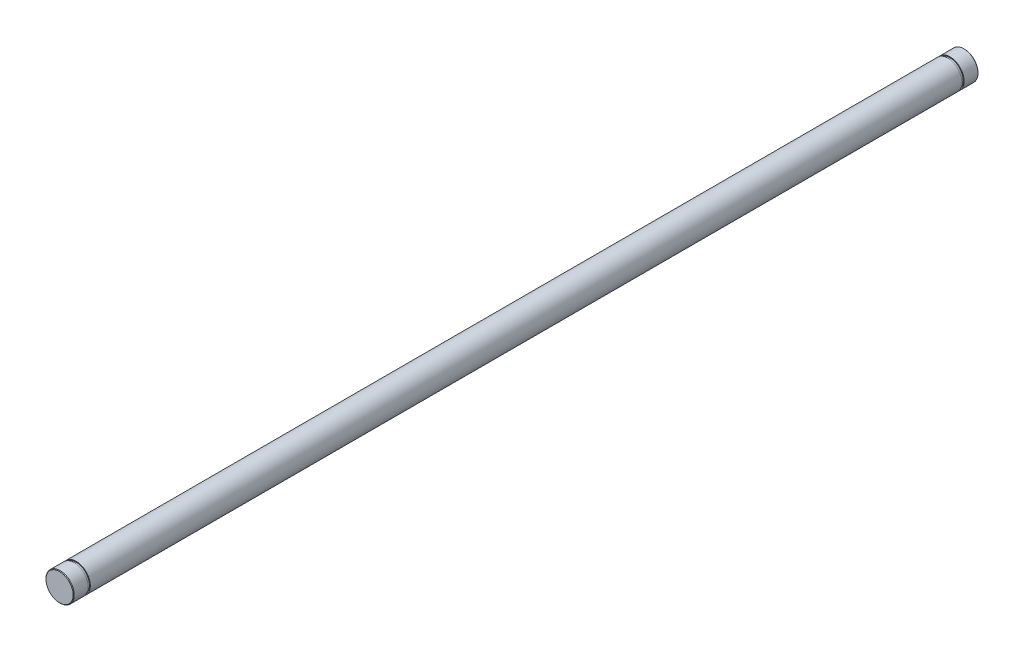
ISO-10303-21;
HEADER;
FILE_DESCRIPTION(('STEP AP214'),'2;1');
FILE_NAME('part.step','',(''),(''),'','','');
FILE_SCHEMA(('AUTOMOTIVE_DESIGN { 1 0 10303 214 1 1 1 1 }'));
ENDSEC;
DATA;
#1=APPLICATION_CONTEXT('core data for automotive mechanical design processes');
#2=APPLICATION_PROTOCOL_DEFINITION('international standard','automotive_design',2000,#1);
#3=PRODUCT_CONTEXT('',#1,'mechanical');
#4=PRODUCT('Part','Part','',(#3));
#5=PRODUCT_RELATED_PRODUCT_CATEGORY('part','',(#4));
#6=PRODUCT_DEFINITION_FORMATION('','',#4);
#7=PRODUCT_DEFINITION_CONTEXT('part definition',#1,'design');
#8=PRODUCT_DEFINITION('design','',#6,#7);
#9=PRODUCT_DEFINITION_SHAPE('','',#8);
#10=(LENGTH_UNIT() NAMED_UNIT(*) SI_UNIT(.MILLI.,.METRE.));
#11=(NAMED_UNIT(*) PLANE_ANGLE_UNIT() SI_UNIT($,.RADIAN.));
#12=(NAMED_UNIT(*) SI_UNIT($,.STERADIAN.) SOLID_ANGLE_UNIT());
#13=UNCERTAINTY_MEASURE_WITH_UNIT(LENGTH_MEASURE(1.E-05),#10,'distance_accuracy_value','');
#14=(GEOMETRIC_REPRESENTATION_CONTEXT(3) GLOBAL_UNCERTAINTY_ASSIGNED_CONTEXT((#13)) GLOBAL_UNIT_ASSIGNED_CONTEXT((#10,
#11,#12)) REPRESENTATION_CONTEXT('',''));
#15=CARTESIAN_POINT('',(0.,0.,0.));
#16=DIRECTION('',(0.,0.,1.));
#17=DIRECTION('',(1.,0.,0.));
#18=AXIS2_PLACEMENT_3D('',#15,#16,#17);
#19=CARTESIAN_POINT('',(0.,0.,152.4));
#20=DIRECTION('',(0.,0.,-1.));
#21=DIRECTION('',(-1.,0.,0.));
#22=AXIS2_PLACEMENT_3D('',#19,#20,#21);
#23=CYLINDRICAL_SURFACE('',#22,4.7625);
#24=CARTESIAN_POINT('',(-5.06087274449011E-13,0.,-147.5366));
#25=DIRECTION('',(0.,0.,1.));
#26=DIRECTION('',(1.,0.,0.));
#27=AXIS2_PLACEMENT_3D('',#24,#25,#26);
#28=CIRCLE('',#27,4.76250000000051);
#29=CARTESIAN_POINT('',(4.7625,0.,-147.5366));
#30=VERTEX_POINT('',#29);
#31=EDGE_CURVE('E69',#30,#30,#28,.T.);
#32=ORIENTED_EDGE('',*,*,#31,.F.);
#33=EDGE_LOOP('',(#32));
#34=FACE_BOUND('',#33,.T.);
#35=CARTESIAN_POINT('',(0.,0.,-152.2095));
#36=DIRECTION('',(0.,0.,1.));
#37=DIRECTION('',(1.,0.,0.));
#38=AXIS2_PLACEMENT_3D('',#35,#36,#37);
#39=CIRCLE('',#38,4.7625);
#40=CARTESIAN_POINT('',(4.7625,0.,-152.2095));
#41=VERTEX_POINT('',#40);
#42=EDGE_CURVE('E56',#41,#41,#39,.T.);
#43=ORIENTED_EDGE('',*,*,#42,.T.);
#44=EDGE_LOOP('',(#43));
#45=FACE_BOUND('',#44,.T.);
#46=ADVANCED_FACE('F45',(#34,#45),#23,.T.);
#47=CARTESIAN_POINT('',(0.,0.,-152.4));
#48=DIRECTION('',(0.,0.,1.));
#49=DIRECTION('',(1.,0.,0.));
#50=AXIS2_PLACEMENT_3D('',#47,#48,#49);
#51=PLANE('',#50);
#52=CARTESIAN_POINT('',(0.,0.,-152.4));
#53=DIRECTION('',(0.,0.,1.));
#54=DIRECTION('',(1.,0.,0.));
#55=AXIS2_PLACEMENT_3D('',#52,#53,#54);
#56=CIRCLE('',#55,4.57199999999969);
#57=CARTESIAN_POINT('',(4.57199999999969,0.,-152.4));
#58=VERTEX_POINT('',#57);
#59=EDGE_CURVE('E52',#58,#58,#56,.F.);
#60=ORIENTED_EDGE('',*,*,#59,.T.);
#61=EDGE_LOOP('',(#60));
#62=FACE_BOUND('',#61,.T.);
#63=ADVANCED_FACE('F94',(#62),#51,.F.);
#64=CARTESIAN_POINT('',(0.,0.,-152.2095));
#65=DIRECTION('',(0.,0.,1.));
#66=DIRECTION('',(1.,0.,0.));
#67=AXIS2_PLACEMENT_3D('',#64,#65,#66);
#68=CONICAL_SURFACE('',#67,4.7625,0.785398163397589);
#69=ORIENTED_EDGE('',*,*,#59,.F.);
#70=EDGE_LOOP('',(#69));
#71=FACE_BOUND('',#70,.T.);
#72=ORIENTED_EDGE('',*,*,#42,.F.);
#73=EDGE_LOOP('',(#72));
#74=FACE_BOUND('',#73,.T.);
#75=ADVANCED_FACE('F100',(#71,#74),#68,.T.);
#76=CARTESIAN_POINT('',(4.7625,0.,-146.8));
#77=DIRECTION('',(0.,0.,1.));
#78=DIRECTION('',(1.,0.,0.));
#79=AXIS2_PLACEMENT_3D('',#76,#77,#78);
#80=PLANE('',#79);
#81=CARTESIAN_POINT('',(-5.03560553036431E-13,0.,-146.8));
#82=DIRECTION('',(0.,0.,1.));
#83=DIRECTION('',(1.,0.,0.));
#84=AXIS2_PLACEMENT_3D('',#81,#82,#83);
#85=CIRCLE('',#84,4.7625000000005);
#86=CARTESIAN_POINT('',(4.7625,0.,-146.8));
#87=VERTEX_POINT('',#86);
#88=EDGE_CURVE('E65',#87,#87,#85,.T.);
#89=ORIENTED_EDGE('',*,*,#88,.F.);
#90=EDGE_LOOP('',(#89));
#91=FACE_BOUND('',#90,.T.);
#92=CARTESIAN_POINT('',(-5.03560553036431E-13,0.,-146.8));
#93=DIRECTION('',(0.,0.,1.));
#94=DIRECTION('',(1.,0.,0.));
#95=AXIS2_PLACEMENT_3D('',#92,#93,#94);
#96=CIRCLE('',#95,4.4704000000005);
#97=CARTESIAN_POINT('',(4.4704,0.,-146.8));
#98=VERTEX_POINT('',#97);
#99=EDGE_CURVE('E81',#98,#98,#96,.T.);
#100=ORIENTED_EDGE('',*,*,#99,.T.);
#101=EDGE_LOOP('',(#100));
#102=FACE_BOUND('',#101,.T.);
#103=ADVANCED_FACE('F102',(#91,#102),#80,.F.);
#104=CARTESIAN_POINT('',(3.43024899888577E-12,0.,1000.));
#105=DIRECTION('',(0.,0.,1.));
#106=DIRECTION('',(1.,0.,0.));
#107=AXIS2_PLACEMENT_3D('',#104,#105,#106);
#108=CYLINDRICAL_SURFACE('',#107,4.4704000000005);
#109=ORIENTED_EDGE('',*,*,#99,.F.);
#110=EDGE_LOOP('',(#109));
#111=FACE_BOUND('',#110,.T.);
#112=CARTESIAN_POINT('',(-5.06087274449011E-13,0.,-147.5366));
#113=DIRECTION('',(0.,0.,1.));
#114=DIRECTION('',(1.,0.,0.));
#115=AXIS2_PLACEMENT_3D('',#112,#113,#114);
#116=CIRCLE('',#115,4.47040000000051);
#117=CARTESIAN_POINT('',(4.4704,0.,-147.5366));
#118=VERTEX_POINT('',#117);
#119=EDGE_CURVE('E84',#118,#118,#116,.T.);
#120=ORIENTED_EDGE('',*,*,#119,.T.);
#121=EDGE_LOOP('',(#120));
#122=FACE_BOUND('',#121,.T.);
#123=ADVANCED_FACE('F109',(#111,#122),#108,.T.);
#124=CARTESIAN_POINT('',(4.7625,0.,-147.5366));
#125=DIRECTION('',(0.,0.,-1.));
#126=DIRECTION('',(-1.,0.,0.));
#127=AXIS2_PLACEMENT_3D('',#124,#125,#126);
#128=PLANE('',#127);
#129=ORIENTED_EDGE('',*,*,#119,.F.);
#130=EDGE_LOOP('',(#129));
#131=FACE_BOUND('',#130,.T.);
#132=ORIENTED_EDGE('',*,*,#31,.T.);
#133=EDGE_LOOP('',(#132));
#134=FACE_BOUND('',#133,.T.);
#135=ADVANCED_FACE('F90',(#131,#134),#128,.F.);
#136=ORIENTED_EDGE('',*,*,#88,.T.);
#137=EDGE_LOOP('',(#136));
#138=FACE_BOUND('',#137,.T.);
#139=CARTESIAN_POINT('',(5.0356055303643E-13,0.,146.8));
#140=DIRECTION('',(0.,0.,1.));
#141=DIRECTION('',(1.,0.,0.));
#142=AXIS2_PLACEMENT_3D('',#139,#140,#141);
#143=CIRCLE('',#142,4.7624999999995);
#144=CARTESIAN_POINT('',(4.7625,0.,146.8));
#145=VERTEX_POINT('',#144);
#146=EDGE_CURVE('E66',#145,#145,#143,.T.);
#147=ORIENTED_EDGE('',*,*,#146,.F.);
#148=EDGE_LOOP('',(#147));
#149=FACE_BOUND('',#148,.T.);
#150=ADVANCED_FACE('F97',(#138,#149),#23,.T.);
#151=CARTESIAN_POINT('',(4.7625,0.,146.8));
#152=DIRECTION('',(0.,0.,-1.));
#153=DIRECTION('',(-1.,0.,0.));
#154=AXIS2_PLACEMENT_3D('',#151,#152,#153);
#155=PLANE('',#154);
#156=CARTESIAN_POINT('',(5.0356055303643E-13,0.,146.8));
#157=DIRECTION('',(0.,0.,1.));
#158=DIRECTION('',(1.,0.,0.));
#159=AXIS2_PLACEMENT_3D('',#156,#157,#158);
#160=CIRCLE('',#159,4.4703999999995);
#161=CARTESIAN_POINT('',(4.4704,0.,146.8));
#162=VERTEX_POINT('',#161);
#163=EDGE_CURVE('E70',#162,#162,#160,.T.);
#164=ORIENTED_EDGE('',*,*,#163,.F.);
#165=EDGE_LOOP('',(#164));
#166=FACE_BOUND('',#165,.T.);
#167=ORIENTED_EDGE('',*,*,#146,.T.);
#168=EDGE_LOOP('',(#167));
#169=FACE_BOUND('',#168,.T.);
#170=ADVANCED_FACE('F120',(#166,#169),#155,.F.);
#171=CARTESIAN_POINT('',(3.43024899888577E-12,0.,1000.));
#172=DIRECTION('',(0.,0.,1.));
#173=DIRECTION('',(1.,0.,0.));
#174=AXIS2_PLACEMENT_3D('',#171,#172,#173);
#175=CYLINDRICAL_SURFACE('',#174,4.47039999999949);
#176=CARTESIAN_POINT('',(5.06087274449009E-13,0.,147.5366));
#177=DIRECTION('',(0.,0.,1.));
#178=DIRECTION('',(1.,0.,0.));
#179=AXIS2_PLACEMENT_3D('',#176,#177,#178);
#180=CIRCLE('',#179,4.47039999999949);
#181=CARTESIAN_POINT('',(4.4704,0.,147.5366));
#182=VERTEX_POINT('',#181);
#183=EDGE_CURVE('E73',#182,#182,#180,.T.);
#184=ORIENTED_EDGE('',*,*,#183,.F.);
#185=EDGE_LOOP('',(#184));
#186=FACE_BOUND('',#185,.T.);
#187=ORIENTED_EDGE('',*,*,#163,.T.);
#188=EDGE_LOOP('',(#187));
#189=FACE_BOUND('',#188,.T.);
#190=ADVANCED_FACE('F123',(#186,#189),#175,.T.);
#191=CARTESIAN_POINT('',(4.7625,0.,147.5366));
#192=DIRECTION('',(0.,0.,1.));
#193=DIRECTION('',(1.,0.,0.));
#194=AXIS2_PLACEMENT_3D('',#191,#192,#193);
#195=PLANE('',#194);
#196=CARTESIAN_POINT('',(5.06087274449009E-13,0.,147.5366));
#197=DIRECTION('',(0.,0.,1.));
#198=DIRECTION('',(1.,0.,0.));
#199=AXIS2_PLACEMENT_3D('',#196,#197,#198);
#200=CIRCLE('',#199,4.76249999999949);
#201=CARTESIAN_POINT('',(4.7625,0.,147.5366));
#202=VERTEX_POINT('',#201);
#203=EDGE_CURVE('E76',#202,#202,#200,.T.);
#204=ORIENTED_EDGE('',*,*,#203,.F.);
#205=EDGE_LOOP('',(#204));
#206=FACE_BOUND('',#205,.T.);
#207=ORIENTED_EDGE('',*,*,#183,.T.);
#208=EDGE_LOOP('',(#207));
#209=FACE_BOUND('',#208,.T.);
#210=ADVANCED_FACE('F118',(#206,#209),#195,.F.);
#211=CARTESIAN_POINT('',(0.,0.,152.4));
#212=DIRECTION('',(0.,0.,1.));
#213=DIRECTION('',(1.,0.,0.));
#214=AXIS2_PLACEMENT_3D('',#211,#212,#213);
#215=PLANE('',#214);
#216=CARTESIAN_POINT('',(0.,0.,152.4));
#217=DIRECTION('',(0.,0.,1.));
#218=DIRECTION('',(1.,0.,0.));
#219=AXIS2_PLACEMENT_3D('',#216,#217,#218);
#220=CIRCLE('',#219,4.57200000000008);
#221=CARTESIAN_POINT('',(4.57200000000008,0.,152.4));
#222=VERTEX_POINT('',#221);
#223=EDGE_CURVE('E10',#222,#222,#220,.T.);
#224=ORIENTED_EDGE('',*,*,#223,.T.);
#225=EDGE_LOOP('',(#224));
#226=FACE_BOUND('',#225,.T.);
#227=ADVANCED_FACE('F116',(#226),#215,.T.);
#228=CARTESIAN_POINT('',(0.,0.,152.4));
#229=DIRECTION('',(0.,0.,-1.));
#230=DIRECTION('',(-1.,0.,0.));
#231=AXIS2_PLACEMENT_3D('',#228,#229,#230);
#232=CONICAL_SURFACE('',#231,4.57200000000008,0.785398163397444);
#233=CARTESIAN_POINT('',(0.,0.,152.2095));
#234=DIRECTION('',(0.,0.,1.));
#235=DIRECTION('',(1.,0.,0.));
#236=AXIS2_PLACEMENT_3D('',#233,#234,#235);
#237=CIRCLE('',#236,4.7625);
#238=CARTESIAN_POINT('',(4.7625,0.,152.2095));
#239=VERTEX_POINT('',#238);
#240=EDGE_CURVE('E60',#239,#239,#237,.F.);
#241=ORIENTED_EDGE('',*,*,#240,.F.);
#242=EDGE_LOOP('',(#241));
#243=FACE_BOUND('',#242,.T.);
#244=ORIENTED_EDGE('',*,*,#223,.F.);
#245=EDGE_LOOP('',(#244));
#246=FACE_BOUND('',#245,.T.);
#247=ADVANCED_FACE('F47',(#243,#246),#232,.T.);
#248=ORIENTED_EDGE('',*,*,#203,.T.);
#249=EDGE_LOOP('',(#248));
#250=FACE_BOUND('',#249,.T.);
#251=ORIENTED_EDGE('',*,*,#240,.T.);
#252=EDGE_LOOP('',(#251));
#253=FACE_BOUND('',#252,.T.);
#254=ADVANCED_FACE('F96',(#250,#253),#23,.T.);
#255=CLOSED_SHELL('',(#46,#63,#75,#103,#123,#135,#150,#170,#190,#210,#227,#247,#254));
#256=MANIFOLD_SOLID_BREP('B2',#255);
#257=ADVANCED_BREP_SHAPE_REPRESENTATION('',(#18,#256),#14);
#258=SHAPE_DEFINITION_REPRESENTATION(#9,#257);
ENDSEC;
END-ISO-10303-21;
